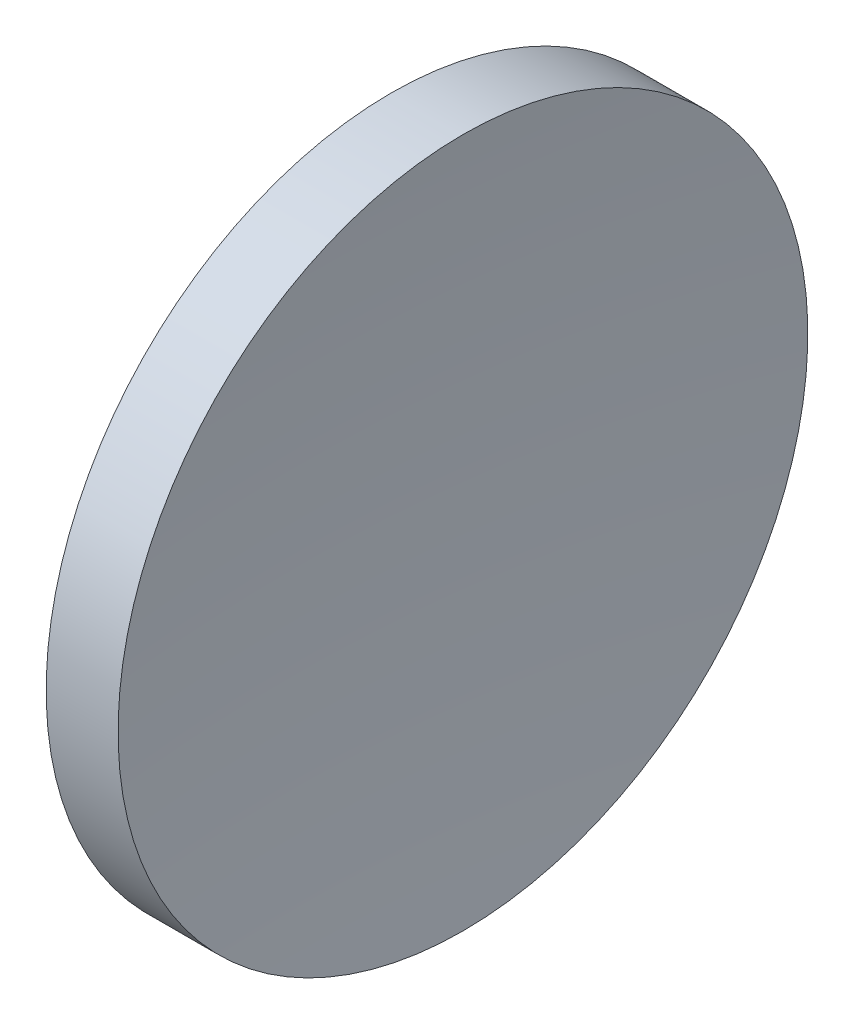
ISO-10303-21;
HEADER;
FILE_DESCRIPTION(('STEP AP214'),'2;1');
FILE_NAME('part.step','',(''),(''),'','','');
FILE_SCHEMA(('AUTOMOTIVE_DESIGN { 1 0 10303 214 1 1 1 1 }'));
ENDSEC;
DATA;
#1=APPLICATION_CONTEXT('core data for automotive mechanical design processes');
#2=APPLICATION_PROTOCOL_DEFINITION('international standard','automotive_design',2000,#1);
#3=PRODUCT_CONTEXT('',#1,'mechanical');
#4=PRODUCT('Part','Part','',(#3));
#5=PRODUCT_RELATED_PRODUCT_CATEGORY('part','',(#4));
#6=PRODUCT_DEFINITION_FORMATION('','',#4);
#7=PRODUCT_DEFINITION_CONTEXT('part definition',#1,'design');
#8=PRODUCT_DEFINITION('design','',#6,#7);
#9=PRODUCT_DEFINITION_SHAPE('','',#8);
#10=(LENGTH_UNIT() NAMED_UNIT(*) SI_UNIT(.MILLI.,.METRE.));
#11=(NAMED_UNIT(*) PLANE_ANGLE_UNIT() SI_UNIT($,.RADIAN.));
#12=(NAMED_UNIT(*) SI_UNIT($,.STERADIAN.) SOLID_ANGLE_UNIT());
#13=UNCERTAINTY_MEASURE_WITH_UNIT(LENGTH_MEASURE(1.E-05),#10,'distance_accuracy_value','');
#14=(GEOMETRIC_REPRESENTATION_CONTEXT(3) GLOBAL_UNCERTAINTY_ASSIGNED_CONTEXT((#13)) GLOBAL_UNIT_ASSIGNED_CONTEXT((#10,
#11,#12)) REPRESENTATION_CONTEXT('',''));
#15=CARTESIAN_POINT('',(0.,0.,0.));
#16=DIRECTION('',(0.,0.,1.));
#17=DIRECTION('',(1.,0.,0.));
#18=AXIS2_PLACEMENT_3D('',#15,#16,#17);
#19=CARTESIAN_POINT('',(188.488190280292,32.5787268553773,0.));
#20=DIRECTION('',(-1.,0.,0.));
#21=DIRECTION('',(0.,-1.,0.));
#22=AXIS2_PLACEMENT_3D('',#19,#20,#21);
#23=SPHERICAL_SURFACE('',#22,129.13);
#24=CARTESIAN_POINT('',(59.9646246452219,32.5787259132931,0.));
#25=DIRECTION('',(-1.,0.,0.));
#26=DIRECTION('',(0.,-1.,0.));
#27=AXIS2_PLACEMENT_3D('',#24,#25,#26);
#28=CIRCLE('',#27,12.5);
#29=CARTESIAN_POINT('',(59.9646246452219,20.0787259132931,0.));
#30=VERTEX_POINT('',#29);
#31=EDGE_CURVE('E10',#30,#30,#28,.T.);
#32=ORIENTED_EDGE('',*,*,#31,.F.);
#33=EDGE_LOOP('',(#32));
#34=FACE_BOUND('',#33,.T.);
#35=ADVANCED_FACE('F35',(#34),#23,.F.);
#36=CARTESIAN_POINT('',(55.0073946244212,32.5787259132931,0.));
#37=DIRECTION('',(-1.,0.,0.));
#38=DIRECTION('',(0.,-1.,0.));
#39=AXIS2_PLACEMENT_3D('',#36,#37,#38);
#40=CYLINDRICAL_SURFACE('',#39,12.5);
#41=CARTESIAN_POINT('',(57.3581901580211,32.5787259132931,0.));
#42=DIRECTION('',(-1.,0.,0.));
#43=DIRECTION('',(0.,-1.,0.));
#44=AXIS2_PLACEMENT_3D('',#41,#42,#43);
#45=CIRCLE('',#44,12.5);
#46=CARTESIAN_POINT('',(57.3581901580211,20.0787259132931,0.));
#47=VERTEX_POINT('',#46);
#48=EDGE_CURVE('E41',#47,#47,#45,.T.);
#49=ORIENTED_EDGE('',*,*,#48,.F.);
#50=EDGE_LOOP('',(#49));
#51=FACE_BOUND('',#50,.T.);
#52=ORIENTED_EDGE('',*,*,#31,.T.);
#53=EDGE_LOOP('',(#52));
#54=FACE_BOUND('',#53,.T.);
#55=ADVANCED_FACE('F49',(#51,#54),#40,.T.);
#56=CARTESIAN_POINT('',(57.3581901580211,32.5787259132931,0.));
#57=DIRECTION('',(1.,0.,0.));
#58=DIRECTION('',(0.,1.,0.));
#59=AXIS2_PLACEMENT_3D('',#56,#57,#58);
#60=PLANE('',#59);
#61=ORIENTED_EDGE('',*,*,#48,.T.);
#62=EDGE_LOOP('',(#61));
#63=FACE_BOUND('',#62,.T.);
#64=ADVANCED_FACE('F47',(#63),#60,.F.);
#65=CLOSED_SHELL('',(#35,#55,#64));
#66=MANIFOLD_SOLID_BREP('B2',#65);
#67=ADVANCED_BREP_SHAPE_REPRESENTATION('',(#18,#66),#14);
#68=SHAPE_DEFINITION_REPRESENTATION(#9,#67);
ENDSEC;
END-ISO-10303-21;
